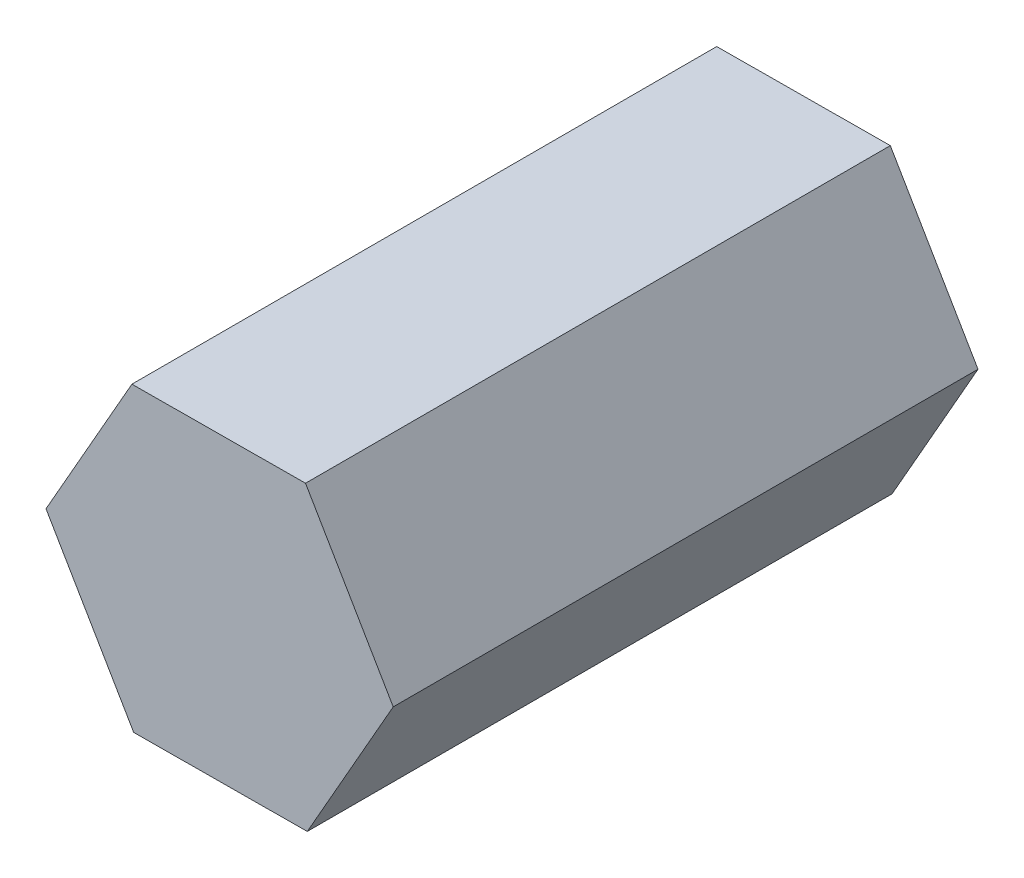
ISO-10303-21;
HEADER;
FILE_DESCRIPTION(('STEP AP214'),'2;1');
FILE_NAME('part.step','',(''),(''),'','','');
FILE_SCHEMA(('AUTOMOTIVE_DESIGN { 1 0 10303 214 1 1 1 1 }'));
ENDSEC;
DATA;
#1=APPLICATION_CONTEXT('core data for automotive mechanical design processes');
#2=APPLICATION_PROTOCOL_DEFINITION('international standard','automotive_design',2000,#1);
#3=PRODUCT_CONTEXT('',#1,'mechanical');
#4=PRODUCT('Part','Part','',(#3));
#5=PRODUCT_RELATED_PRODUCT_CATEGORY('part','',(#4));
#6=PRODUCT_DEFINITION_FORMATION('','',#4);
#7=PRODUCT_DEFINITION_CONTEXT('part definition',#1,'design');
#8=PRODUCT_DEFINITION('design','',#6,#7);
#9=PRODUCT_DEFINITION_SHAPE('','',#8);
#10=(LENGTH_UNIT() NAMED_UNIT(*) SI_UNIT(.MILLI.,.METRE.));
#11=(NAMED_UNIT(*) PLANE_ANGLE_UNIT() SI_UNIT($,.RADIAN.));
#12=(NAMED_UNIT(*) SI_UNIT($,.STERADIAN.) SOLID_ANGLE_UNIT());
#13=UNCERTAINTY_MEASURE_WITH_UNIT(LENGTH_MEASURE(1.E-05),#10,'distance_accuracy_value','');
#14=(GEOMETRIC_REPRESENTATION_CONTEXT(3) GLOBAL_UNCERTAINTY_ASSIGNED_CONTEXT((#13)) GLOBAL_UNIT_ASSIGNED_CONTEXT((#10,
#11,#12)) REPRESENTATION_CONTEXT('',''));
#15=CARTESIAN_POINT('',(0.,0.,0.));
#16=DIRECTION('',(0.,0.,1.));
#17=DIRECTION('',(1.,0.,0.));
#18=AXIS2_PLACEMENT_3D('',#15,#16,#17);
#19=CARTESIAN_POINT('',(23.5086901327095,41.274586469694,160.));
#20=DIRECTION('',(0.00585621832050479,-0.999982852206468,0.));
#21=DIRECTION('',(0.999982852206468,0.00585621832050479,0.));
#22=AXIS2_PLACEMENT_3D('',#19,#20,#21);
#23=PLANE('',#22);
#24=DIRECTION('',(-0.999982852206468,-0.00585621832050479,0.));
#25=VECTOR('',#24,1.);
#26=CARTESIAN_POINT('',(23.5086901327095,41.274586469694,0.));
#27=LINE('',#26,#25);
#28=CARTESIAN_POINT('',(23.5086901327095,41.274586469694,0.));
#29=VERTEX_POINT('',#28);
#30=CARTESIAN_POINT('',(-23.9904953470977,40.99641609947,0.));
#31=VERTEX_POINT('',#30);
#32=EDGE_CURVE('E117',#29,#31,#27,.T.);
#33=ORIENTED_EDGE('',*,*,#32,.T.);
#34=DIRECTION('',(0.,0.,-1.));
#35=VECTOR('',#34,1.);
#36=CARTESIAN_POINT('',(-23.9904953470977,40.99641609947,160.));
#37=LINE('',#36,#35);
#38=CARTESIAN_POINT('',(-23.9904953470977,40.99641609947,160.));
#39=VERTEX_POINT('',#38);
#40=EDGE_CURVE('E11',#39,#31,#37,.T.);
#41=ORIENTED_EDGE('',*,*,#40,.F.);
#42=DIRECTION('',(-0.999982852206468,-0.00585621832050479,0.));
#43=VECTOR('',#42,1.);
#44=CARTESIAN_POINT('',(23.5086901327095,41.274586469694,160.));
#45=LINE('',#44,#43);
#46=CARTESIAN_POINT('',(23.5086901327095,41.274586469694,160.));
#47=VERTEX_POINT('',#46);
#48=EDGE_CURVE('E127',#47,#39,#45,.T.);
#49=ORIENTED_EDGE('',*,*,#48,.F.);
#50=DIRECTION('',(0.,0.,-1.));
#51=VECTOR('',#50,1.);
#52=CARTESIAN_POINT('',(23.5086901327095,41.274586469694,160.));
#53=LINE('',#52,#51);
#54=EDGE_CURVE('E113',#47,#29,#53,.T.);
#55=ORIENTED_EDGE('',*,*,#54,.T.);
#56=EDGE_LOOP('',(#33,#41,#49,#55));
#57=FACE_BOUND('',#56,.T.);
#58=ADVANCED_FACE('F33',(#57),#23,.F.);
#59=CARTESIAN_POINT('',(-23.9904953470977,40.99641609947,160.));
#60=DIRECTION('',(0.868938662519874,-0.494919792267568,0.));
#61=DIRECTION('',(0.494919792267568,0.868938662519874,0.));
#62=AXIS2_PLACEMENT_3D('',#59,#60,#61);
#63=PLANE('',#62);
#64=DIRECTION('',(-0.494919792267568,-0.868938662519874,0.));
#65=VECTOR('',#64,1.);
#66=CARTESIAN_POINT('',(-23.9904953470977,40.99641609947,0.));
#67=LINE('',#66,#65);
#68=CARTESIAN_POINT('',(-47.4991854798072,-0.278170370223992,0.));
#69=VERTEX_POINT('',#68);
#70=EDGE_CURVE('E120',#31,#69,#67,.T.);
#71=ORIENTED_EDGE('',*,*,#70,.T.);
#72=DIRECTION('',(0.,0.,-1.));
#73=VECTOR('',#72,1.);
#74=CARTESIAN_POINT('',(-47.4991854798072,-0.278170370223992,160.));
#75=LINE('',#74,#73);
#76=CARTESIAN_POINT('',(-47.4991854798072,-0.278170370223992,160.));
#77=VERTEX_POINT('',#76);
#78=EDGE_CURVE('E41',#77,#69,#75,.T.);
#79=ORIENTED_EDGE('',*,*,#78,.F.);
#80=DIRECTION('',(-0.494919792267568,-0.868938662519874,0.));
#81=VECTOR('',#80,1.);
#82=CARTESIAN_POINT('',(-23.9904953470977,40.99641609947,160.));
#83=LINE('',#82,#81);
#84=EDGE_CURVE('E86',#39,#77,#83,.T.);
#85=ORIENTED_EDGE('',*,*,#84,.F.);
#86=ORIENTED_EDGE('',*,*,#40,.T.);
#87=EDGE_LOOP('',(#71,#79,#85,#86));
#88=FACE_BOUND('',#87,.T.);
#89=ADVANCED_FACE('F151',(#88),#63,.F.);
#90=CARTESIAN_POINT('',(-47.4991854798072,-0.278170370223992,160.));
#91=DIRECTION('',(0.863082444199368,0.505063059938899,0.));
#92=DIRECTION('',(-0.505063059938899,0.863082444199368,0.));
#93=AXIS2_PLACEMENT_3D('',#90,#91,#92);
#94=PLANE('',#93);
#95=DIRECTION('',(0.505063059938899,-0.863082444199368,0.));
#96=VECTOR('',#95,1.);
#97=CARTESIAN_POINT('',(-47.4991854798072,-0.278170370223992,0.));
#98=LINE('',#97,#96);
#99=CARTESIAN_POINT('',(-23.5086901327095,-41.274586469694,0.));
#100=VERTEX_POINT('',#99);
#101=EDGE_CURVE('E122',#69,#100,#98,.T.);
#102=ORIENTED_EDGE('',*,*,#101,.T.);
#103=DIRECTION('',(0.,0.,-1.));
#104=VECTOR('',#103,1.);
#105=CARTESIAN_POINT('',(-23.5086901327095,-41.274586469694,160.));
#106=LINE('',#105,#104);
#107=CARTESIAN_POINT('',(-23.5086901327095,-41.274586469694,160.));
#108=VERTEX_POINT('',#107);
#109=EDGE_CURVE('E108',#108,#100,#106,.T.);
#110=ORIENTED_EDGE('',*,*,#109,.F.);
#111=DIRECTION('',(0.505063059938899,-0.863082444199368,0.));
#112=VECTOR('',#111,1.);
#113=CARTESIAN_POINT('',(-47.4991854798072,-0.278170370223992,160.));
#114=LINE('',#113,#112);
#115=EDGE_CURVE('E99',#77,#108,#114,.T.);
#116=ORIENTED_EDGE('',*,*,#115,.F.);
#117=ORIENTED_EDGE('',*,*,#78,.T.);
#118=EDGE_LOOP('',(#102,#110,#116,#117));
#119=FACE_BOUND('',#118,.T.);
#120=ADVANCED_FACE('F133',(#119),#94,.F.);
#121=CARTESIAN_POINT('',(-23.5086901327095,-41.274586469694,160.));
#122=DIRECTION('',(-0.00585621832050494,0.999982852206468,0.));
#123=DIRECTION('',(-0.999982852206468,-0.00585621832050494,0.));
#124=AXIS2_PLACEMENT_3D('',#121,#122,#123);
#125=PLANE('',#124);
#126=DIRECTION('',(0.999982852206468,0.00585621832050494,0.));
#127=VECTOR('',#126,1.);
#128=CARTESIAN_POINT('',(-23.5086901327095,-41.274586469694,0.));
#129=LINE('',#128,#127);
#130=CARTESIAN_POINT('',(23.9904953470977,-40.99641609947,0.));
#131=VERTEX_POINT('',#130);
#132=EDGE_CURVE('E107',#100,#131,#129,.T.);
#133=ORIENTED_EDGE('',*,*,#132,.T.);
#134=DIRECTION('',(0.,0.,-1.));
#135=VECTOR('',#134,1.);
#136=CARTESIAN_POINT('',(23.9904953470977,-40.99641609947,160.));
#137=LINE('',#136,#135);
#138=CARTESIAN_POINT('',(23.9904953470977,-40.99641609947,160.));
#139=VERTEX_POINT('',#138);
#140=EDGE_CURVE('E104',#139,#131,#137,.T.);
#141=ORIENTED_EDGE('',*,*,#140,.F.);
#142=DIRECTION('',(0.999982852206468,0.00585621832050494,0.));
#143=VECTOR('',#142,1.);
#144=CARTESIAN_POINT('',(-23.5086901327095,-41.274586469694,160.));
#145=LINE('',#144,#143);
#146=EDGE_CURVE('E93',#108,#139,#145,.T.);
#147=ORIENTED_EDGE('',*,*,#146,.F.);
#148=ORIENTED_EDGE('',*,*,#109,.T.);
#149=EDGE_LOOP('',(#133,#141,#147,#148));
#150=FACE_BOUND('',#149,.T.);
#151=ADVANCED_FACE('F105',(#150),#125,.F.);
#152=CARTESIAN_POINT('',(23.9904953470977,-40.99641609947,160.));
#153=DIRECTION('',(-0.868938662519874,0.494919792267568,0.));
#154=DIRECTION('',(-0.494919792267569,-0.868938662519874,0.));
#155=AXIS2_PLACEMENT_3D('',#152,#153,#154);
#156=PLANE('',#155);
#157=DIRECTION('',(0.494919792267568,0.868938662519874,0.));
#158=VECTOR('',#157,1.);
#159=CARTESIAN_POINT('',(23.9904953470977,-40.99641609947,0.));
#160=LINE('',#159,#158);
#161=CARTESIAN_POINT('',(47.4991854798072,0.278170370224,0.));
#162=VERTEX_POINT('',#161);
#163=EDGE_CURVE('E72',#131,#162,#160,.T.);
#164=ORIENTED_EDGE('',*,*,#163,.T.);
#165=DIRECTION('',(0.,0.,-1.));
#166=VECTOR('',#165,1.);
#167=CARTESIAN_POINT('',(47.4991854798072,0.278170370224,160.));
#168=LINE('',#167,#166);
#169=CARTESIAN_POINT('',(47.4991854798072,0.278170370224,160.));
#170=VERTEX_POINT('',#169);
#171=EDGE_CURVE('E109',#170,#162,#168,.T.);
#172=ORIENTED_EDGE('',*,*,#171,.F.);
#173=DIRECTION('',(0.494919792267568,0.868938662519874,0.));
#174=VECTOR('',#173,1.);
#175=CARTESIAN_POINT('',(23.9904953470977,-40.99641609947,160.));
#176=LINE('',#175,#174);
#177=EDGE_CURVE('E97',#139,#170,#176,.T.);
#178=ORIENTED_EDGE('',*,*,#177,.F.);
#179=ORIENTED_EDGE('',*,*,#140,.T.);
#180=EDGE_LOOP('',(#164,#172,#178,#179));
#181=FACE_BOUND('',#180,.T.);
#182=ADVANCED_FACE('F111',(#181),#156,.F.);
#183=CARTESIAN_POINT('',(47.4991854798072,0.278170370224,160.));
#184=DIRECTION('',(-0.863082444199369,-0.505063059938899,0.));
#185=DIRECTION('',(0.505063059938899,-0.863082444199369,0.));
#186=AXIS2_PLACEMENT_3D('',#183,#184,#185);
#187=PLANE('',#186);
#188=DIRECTION('',(-0.505063059938899,0.863082444199369,0.));
#189=VECTOR('',#188,1.);
#190=CARTESIAN_POINT('',(47.4991854798072,0.278170370224,0.));
#191=LINE('',#190,#189);
#192=EDGE_CURVE('E78',#162,#29,#191,.T.);
#193=ORIENTED_EDGE('',*,*,#192,.T.);
#194=ORIENTED_EDGE('',*,*,#54,.F.);
#195=DIRECTION('',(-0.505063059938899,0.863082444199369,0.));
#196=VECTOR('',#195,1.);
#197=CARTESIAN_POINT('',(47.4991854798072,0.278170370224,160.));
#198=LINE('',#197,#196);
#199=EDGE_CURVE('E49',#170,#47,#198,.T.);
#200=ORIENTED_EDGE('',*,*,#199,.F.);
#201=ORIENTED_EDGE('',*,*,#171,.T.);
#202=EDGE_LOOP('',(#193,#194,#200,#201));
#203=FACE_BOUND('',#202,.T.);
#204=ADVANCED_FACE('F140',(#203),#187,.F.);
#205=CARTESIAN_POINT('',(0.,0.,160.));
#206=DIRECTION('',(0.,0.,1.));
#207=DIRECTION('',(1.,0.,0.));
#208=AXIS2_PLACEMENT_3D('',#205,#206,#207);
#209=PLANE('',#208);
#210=ORIENTED_EDGE('',*,*,#48,.T.);
#211=ORIENTED_EDGE('',*,*,#84,.T.);
#212=ORIENTED_EDGE('',*,*,#115,.T.);
#213=ORIENTED_EDGE('',*,*,#146,.T.);
#214=ORIENTED_EDGE('',*,*,#177,.T.);
#215=ORIENTED_EDGE('',*,*,#199,.T.);
#216=EDGE_LOOP('',(#210,#211,#212,#213,#214,#215));
#217=FACE_BOUND('',#216,.T.);
#218=ADVANCED_FACE('F95',(#217),#209,.T.);
#219=CARTESIAN_POINT('',(0.,0.,0.));
#220=DIRECTION('',(0.,0.,1.));
#221=DIRECTION('',(1.,0.,0.));
#222=AXIS2_PLACEMENT_3D('',#219,#220,#221);
#223=PLANE('',#222);
#224=ORIENTED_EDGE('',*,*,#32,.F.);
#225=ORIENTED_EDGE('',*,*,#192,.F.);
#226=ORIENTED_EDGE('',*,*,#163,.F.);
#227=ORIENTED_EDGE('',*,*,#132,.F.);
#228=ORIENTED_EDGE('',*,*,#101,.F.);
#229=ORIENTED_EDGE('',*,*,#70,.F.);
#230=EDGE_LOOP('',(#224,#225,#226,#227,#228,#229));
#231=FACE_BOUND('',#230,.T.);
#232=ADVANCED_FACE('F136',(#231),#223,.F.);
#233=CLOSED_SHELL('',(#58,#89,#120,#151,#182,#204,#218,#232));
#234=MANIFOLD_SOLID_BREP('B2',#233);
#235=ADVANCED_BREP_SHAPE_REPRESENTATION('',(#18,#234),#14);
#236=SHAPE_DEFINITION_REPRESENTATION(#9,#235);
ENDSEC;
END-ISO-10303-21;
